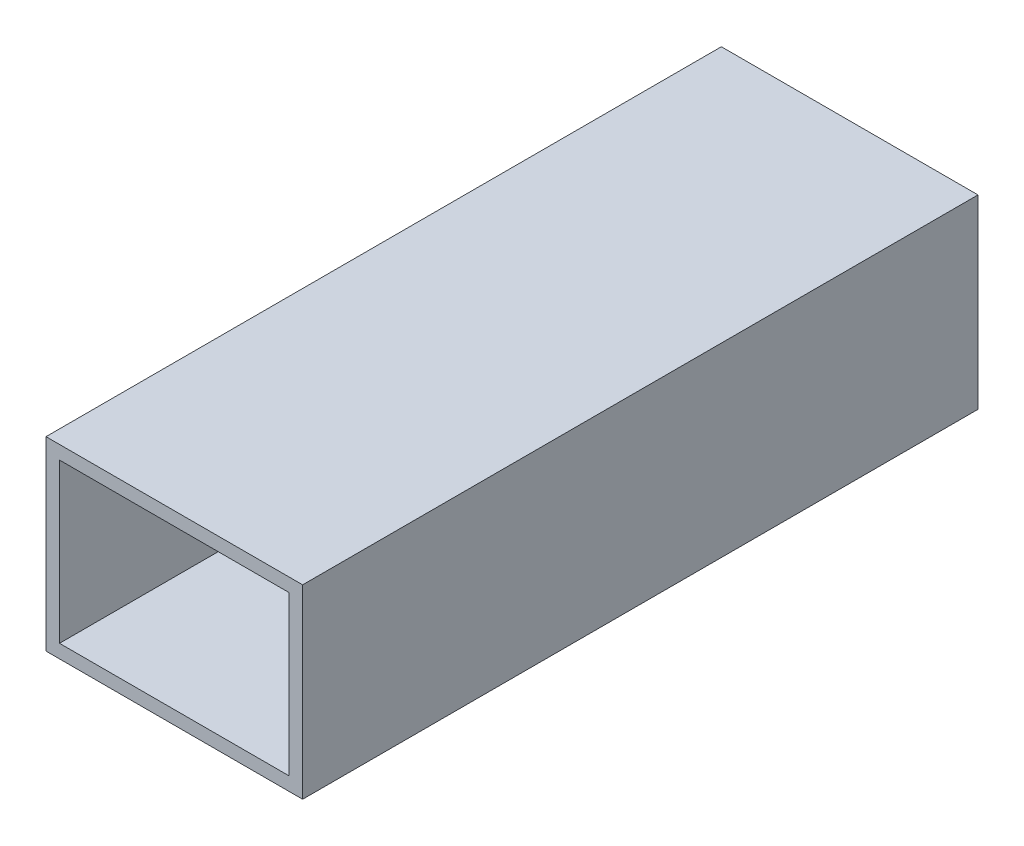
ISO-10303-21;
HEADER;
FILE_DESCRIPTION(('STEP AP214'),'2;1');
FILE_NAME('part.step','',(''),(''),'','','');
FILE_SCHEMA(('AUTOMOTIVE_DESIGN { 1 0 10303 214 1 1 1 1 }'));
ENDSEC;
DATA;
#1=APPLICATION_CONTEXT('core data for automotive mechanical design processes');
#2=APPLICATION_PROTOCOL_DEFINITION('international standard','automotive_design',2000,#1);
#3=PRODUCT_CONTEXT('',#1,'mechanical');
#4=PRODUCT('Part','Part','',(#3));
#5=PRODUCT_RELATED_PRODUCT_CATEGORY('part','',(#4));
#6=PRODUCT_DEFINITION_FORMATION('','',#4);
#7=PRODUCT_DEFINITION_CONTEXT('part definition',#1,'design');
#8=PRODUCT_DEFINITION('design','',#6,#7);
#9=PRODUCT_DEFINITION_SHAPE('','',#8);
#10=(LENGTH_UNIT() NAMED_UNIT(*) SI_UNIT(.MILLI.,.METRE.));
#11=(NAMED_UNIT(*) PLANE_ANGLE_UNIT() SI_UNIT($,.RADIAN.));
#12=(NAMED_UNIT(*) SI_UNIT($,.STERADIAN.) SOLID_ANGLE_UNIT());
#13=UNCERTAINTY_MEASURE_WITH_UNIT(LENGTH_MEASURE(1.E-05),#10,'distance_accuracy_value','');
#14=(GEOMETRIC_REPRESENTATION_CONTEXT(3) GLOBAL_UNCERTAINTY_ASSIGNED_CONTEXT((#13)) GLOBAL_UNIT_ASSIGNED_CONTEXT((#10,
#11,#12)) REPRESENTATION_CONTEXT('',''));
#15=CARTESIAN_POINT('',(0.,0.,0.));
#16=DIRECTION('',(0.,0.,1.));
#17=DIRECTION('',(1.,0.,0.));
#18=AXIS2_PLACEMENT_3D('',#15,#16,#17);
#19=CARTESIAN_POINT('',(0.,0.,100.));
#20=DIRECTION('',(0.,0.,1.));
#21=DIRECTION('',(1.,0.,0.));
#22=AXIS2_PLACEMENT_3D('',#19,#20,#21);
#23=PLANE('',#22);
#24=DIRECTION('',(0.,-1.,0.));
#25=VECTOR('',#24,1.);
#26=CARTESIAN_POINT('',(-17.1253333333333,14.6066666666667,100.));
#27=LINE('',#26,#25);
#28=CARTESIAN_POINT('',(-17.1253333333333,14.6066666666667,100.));
#29=VERTEX_POINT('',#28);
#30=CARTESIAN_POINT('',(-17.1253333333333,-12.8933333333333,100.));
#31=VERTEX_POINT('',#30);
#32=EDGE_CURVE('E135',#29,#31,#27,.T.);
#33=ORIENTED_EDGE('',*,*,#32,.T.);
#34=DIRECTION('',(1.,0.,0.));
#35=VECTOR('',#34,1.);
#36=CARTESIAN_POINT('',(-17.1253333333333,-12.8933333333333,100.));
#37=LINE('',#36,#35);
#38=CARTESIAN_POINT('',(20.8746666666667,-12.8933333333333,100.));
#39=VERTEX_POINT('',#38);
#40=EDGE_CURVE('E138',#31,#39,#37,.T.);
#41=ORIENTED_EDGE('',*,*,#40,.T.);
#42=DIRECTION('',(0.,1.,0.));
#43=VECTOR('',#42,1.);
#44=CARTESIAN_POINT('',(20.8746666666667,14.6066666666667,100.));
#45=LINE('',#44,#43);
#46=CARTESIAN_POINT('',(20.8746666666667,14.6066666666667,100.));
#47=VERTEX_POINT('',#46);
#48=EDGE_CURVE('E141',#39,#47,#45,.T.);
#49=ORIENTED_EDGE('',*,*,#48,.T.);
#50=DIRECTION('',(-1.,0.,0.));
#51=VECTOR('',#50,1.);
#52=CARTESIAN_POINT('',(-17.1253333333333,14.6066666666667,100.));
#53=LINE('',#52,#51);
#54=EDGE_CURVE('E143',#47,#29,#53,.T.);
#55=ORIENTED_EDGE('',*,*,#54,.T.);
#56=EDGE_LOOP('',(#33,#41,#49,#55));
#57=FACE_BOUND('',#56,.T.);
#58=DIRECTION('',(1.,0.,0.));
#59=VECTOR('',#58,1.);
#60=CARTESIAN_POINT('',(-15.1253333333333,-10.8933333333333,100.));
#61=LINE('',#60,#59);
#62=CARTESIAN_POINT('',(-15.1253333333333,-10.8933333333333,100.));
#63=VERTEX_POINT('',#62);
#64=CARTESIAN_POINT('',(18.8746666666667,-10.8933333333333,100.));
#65=VERTEX_POINT('',#64);
#66=EDGE_CURVE('E107',#63,#65,#61,.T.);
#67=ORIENTED_EDGE('',*,*,#66,.F.);
#68=DIRECTION('',(0.,-1.,0.));
#69=VECTOR('',#68,1.);
#70=CARTESIAN_POINT('',(-15.1253333333333,12.6066666666667,100.));
#71=LINE('',#70,#69);
#72=CARTESIAN_POINT('',(-15.1253333333333,12.6066666666667,100.));
#73=VERTEX_POINT('',#72);
#74=EDGE_CURVE('E99',#73,#63,#71,.T.);
#75=ORIENTED_EDGE('',*,*,#74,.F.);
#76=DIRECTION('',(-1.,0.,0.));
#77=VECTOR('',#76,1.);
#78=CARTESIAN_POINT('',(-15.1253333333333,12.6066666666667,100.));
#79=LINE('',#78,#77);
#80=CARTESIAN_POINT('',(18.8746666666667,12.6066666666667,100.));
#81=VERTEX_POINT('',#80);
#82=EDGE_CURVE('E121',#81,#73,#79,.T.);
#83=ORIENTED_EDGE('',*,*,#82,.F.);
#84=DIRECTION('',(0.,1.,0.));
#85=VECTOR('',#84,1.);
#86=CARTESIAN_POINT('',(18.8746666666667,12.6066666666667,100.));
#87=LINE('',#86,#85);
#88=EDGE_CURVE('E119',#65,#81,#87,.T.);
#89=ORIENTED_EDGE('',*,*,#88,.F.);
#90=EDGE_LOOP('',(#67,#75,#83,#89));
#91=FACE_BOUND('',#90,.T.);
#92=ADVANCED_FACE('F34',(#57,#91),#23,.T.);
#93=CARTESIAN_POINT('',(0.,0.,0.));
#94=DIRECTION('',(0.,0.,1.));
#95=DIRECTION('',(1.,0.,0.));
#96=AXIS2_PLACEMENT_3D('',#93,#94,#95);
#97=PLANE('',#96);
#98=DIRECTION('',(0.,-1.,0.));
#99=VECTOR('',#98,1.);
#100=CARTESIAN_POINT('',(-17.1253333333333,14.6066666666667,0.));
#101=LINE('',#100,#99);
#102=CARTESIAN_POINT('',(-17.1253333333333,14.6066666666667,0.));
#103=VERTEX_POINT('',#102);
#104=CARTESIAN_POINT('',(-17.1253333333333,-12.8933333333333,0.));
#105=VERTEX_POINT('',#104);
#106=EDGE_CURVE('E115',#103,#105,#101,.T.);
#107=ORIENTED_EDGE('',*,*,#106,.F.);
#108=DIRECTION('',(-1.,0.,0.));
#109=VECTOR('',#108,1.);
#110=CARTESIAN_POINT('',(-17.1253333333333,14.6066666666667,0.));
#111=LINE('',#110,#109);
#112=CARTESIAN_POINT('',(20.8746666666667,14.6066666666667,0.));
#113=VERTEX_POINT('',#112);
#114=EDGE_CURVE('E139',#113,#103,#111,.T.);
#115=ORIENTED_EDGE('',*,*,#114,.F.);
#116=DIRECTION('',(0.,1.,0.));
#117=VECTOR('',#116,1.);
#118=CARTESIAN_POINT('',(20.8746666666667,14.6066666666667,0.));
#119=LINE('',#118,#117);
#120=CARTESIAN_POINT('',(20.8746666666667,-12.8933333333333,0.));
#121=VERTEX_POINT('',#120);
#122=EDGE_CURVE('E150',#121,#113,#119,.T.);
#123=ORIENTED_EDGE('',*,*,#122,.F.);
#124=DIRECTION('',(1.,0.,0.));
#125=VECTOR('',#124,1.);
#126=CARTESIAN_POINT('',(-17.1253333333333,-12.8933333333333,0.));
#127=LINE('',#126,#125);
#128=EDGE_CURVE('E148',#105,#121,#127,.T.);
#129=ORIENTED_EDGE('',*,*,#128,.F.);
#130=EDGE_LOOP('',(#107,#115,#123,#129));
#131=FACE_BOUND('',#130,.T.);
#132=DIRECTION('',(0.,-1.,0.));
#133=VECTOR('',#132,1.);
#134=CARTESIAN_POINT('',(-15.1253333333333,12.6066666666667,0.));
#135=LINE('',#134,#133);
#136=CARTESIAN_POINT('',(-15.1253333333333,12.6066666666667,0.));
#137=VERTEX_POINT('',#136);
#138=CARTESIAN_POINT('',(-15.1253333333333,-10.8933333333333,0.));
#139=VERTEX_POINT('',#138);
#140=EDGE_CURVE('E57',#137,#139,#135,.T.);
#141=ORIENTED_EDGE('',*,*,#140,.T.);
#142=DIRECTION('',(1.,0.,0.));
#143=VECTOR('',#142,1.);
#144=CARTESIAN_POINT('',(-15.1253333333333,-10.8933333333333,0.));
#145=LINE('',#144,#143);
#146=CARTESIAN_POINT('',(18.8746666666667,-10.8933333333333,0.));
#147=VERTEX_POINT('',#146);
#148=EDGE_CURVE('E114',#139,#147,#145,.T.);
#149=ORIENTED_EDGE('',*,*,#148,.T.);
#150=DIRECTION('',(0.,1.,0.));
#151=VECTOR('',#150,1.);
#152=CARTESIAN_POINT('',(18.8746666666667,12.6066666666667,0.));
#153=LINE('',#152,#151);
#154=CARTESIAN_POINT('',(18.8746666666667,12.6066666666667,0.));
#155=VERTEX_POINT('',#154);
#156=EDGE_CURVE('E127',#147,#155,#153,.T.);
#157=ORIENTED_EDGE('',*,*,#156,.T.);
#158=DIRECTION('',(-1.,0.,0.));
#159=VECTOR('',#158,1.);
#160=CARTESIAN_POINT('',(-15.1253333333333,12.6066666666667,0.));
#161=LINE('',#160,#159);
#162=EDGE_CURVE('E108',#155,#137,#161,.T.);
#163=ORIENTED_EDGE('',*,*,#162,.T.);
#164=EDGE_LOOP('',(#141,#149,#157,#163));
#165=FACE_BOUND('',#164,.T.);
#166=ADVANCED_FACE('F168',(#131,#165),#97,.F.);
#167=CARTESIAN_POINT('',(-17.1253333333333,14.6066666666667,100.));
#168=DIRECTION('',(1.,0.,0.));
#169=DIRECTION('',(0.,0.,-1.));
#170=AXIS2_PLACEMENT_3D('',#167,#168,#169);
#171=PLANE('',#170);
#172=ORIENTED_EDGE('',*,*,#106,.T.);
#173=DIRECTION('',(0.,0.,-1.));
#174=VECTOR('',#173,1.);
#175=CARTESIAN_POINT('',(-17.1253333333333,-12.8933333333333,100.));
#176=LINE('',#175,#174);
#177=EDGE_CURVE('E11',#31,#105,#176,.T.);
#178=ORIENTED_EDGE('',*,*,#177,.F.);
#179=ORIENTED_EDGE('',*,*,#32,.F.);
#180=DIRECTION('',(0.,0.,-1.));
#181=VECTOR('',#180,1.);
#182=CARTESIAN_POINT('',(-17.1253333333333,14.6066666666667,100.));
#183=LINE('',#182,#181);
#184=EDGE_CURVE('E145',#29,#103,#183,.T.);
#185=ORIENTED_EDGE('',*,*,#184,.T.);
#186=EDGE_LOOP('',(#172,#178,#179,#185));
#187=FACE_BOUND('',#186,.T.);
#188=ADVANCED_FACE('F36',(#187),#171,.F.);
#189=CARTESIAN_POINT('',(-17.1253333333333,-12.8933333333333,100.));
#190=DIRECTION('',(0.,1.,0.));
#191=DIRECTION('',(-1.,0.,0.));
#192=AXIS2_PLACEMENT_3D('',#189,#190,#191);
#193=PLANE('',#192);
#194=ORIENTED_EDGE('',*,*,#128,.T.);
#195=DIRECTION('',(0.,0.,-1.));
#196=VECTOR('',#195,1.);
#197=CARTESIAN_POINT('',(20.8746666666667,-12.8933333333333,100.));
#198=LINE('',#197,#196);
#199=EDGE_CURVE('E42',#39,#121,#198,.T.);
#200=ORIENTED_EDGE('',*,*,#199,.F.);
#201=ORIENTED_EDGE('',*,*,#40,.F.);
#202=ORIENTED_EDGE('',*,*,#177,.T.);
#203=EDGE_LOOP('',(#194,#200,#201,#202));
#204=FACE_BOUND('',#203,.T.);
#205=ADVANCED_FACE('F178',(#204),#193,.F.);
#206=CARTESIAN_POINT('',(20.8746666666667,14.6066666666667,100.));
#207=DIRECTION('',(-1.,0.,0.));
#208=DIRECTION('',(0.,-1.,0.));
#209=AXIS2_PLACEMENT_3D('',#206,#207,#208);
#210=PLANE('',#209);
#211=ORIENTED_EDGE('',*,*,#122,.T.);
#212=DIRECTION('',(0.,0.,-1.));
#213=VECTOR('',#212,1.);
#214=CARTESIAN_POINT('',(20.8746666666667,14.6066666666667,100.));
#215=LINE('',#214,#213);
#216=EDGE_CURVE('E155',#47,#113,#215,.T.);
#217=ORIENTED_EDGE('',*,*,#216,.F.);
#218=ORIENTED_EDGE('',*,*,#48,.F.);
#219=ORIENTED_EDGE('',*,*,#199,.T.);
#220=EDGE_LOOP('',(#211,#217,#218,#219));
#221=FACE_BOUND('',#220,.T.);
#222=ADVANCED_FACE('F162',(#221),#210,.F.);
#223=CARTESIAN_POINT('',(-17.1253333333333,14.6066666666667,100.));
#224=DIRECTION('',(0.,-1.,0.));
#225=DIRECTION('',(0.,0.,-1.));
#226=AXIS2_PLACEMENT_3D('',#223,#224,#225);
#227=PLANE('',#226);
#228=ORIENTED_EDGE('',*,*,#114,.T.);
#229=ORIENTED_EDGE('',*,*,#184,.F.);
#230=ORIENTED_EDGE('',*,*,#54,.F.);
#231=ORIENTED_EDGE('',*,*,#216,.T.);
#232=EDGE_LOOP('',(#228,#229,#230,#231));
#233=FACE_BOUND('',#232,.T.);
#234=ADVANCED_FACE('F172',(#233),#227,.F.);
#235=CARTESIAN_POINT('',(-15.1253333333333,12.6066666666667,100.));
#236=DIRECTION('',(1.,0.,0.));
#237=DIRECTION('',(0.,1.,0.));
#238=AXIS2_PLACEMENT_3D('',#235,#236,#237);
#239=PLANE('',#238);
#240=ORIENTED_EDGE('',*,*,#140,.F.);
#241=DIRECTION('',(0.,0.,-1.));
#242=VECTOR('',#241,1.);
#243=CARTESIAN_POINT('',(-15.1253333333333,12.6066666666667,100.));
#244=LINE('',#243,#242);
#245=EDGE_CURVE('E103',#73,#137,#244,.T.);
#246=ORIENTED_EDGE('',*,*,#245,.F.);
#247=ORIENTED_EDGE('',*,*,#74,.T.);
#248=DIRECTION('',(0.,0.,-1.));
#249=VECTOR('',#248,1.);
#250=CARTESIAN_POINT('',(-15.1253333333333,-10.8933333333333,100.));
#251=LINE('',#250,#249);
#252=EDGE_CURVE('E102',#63,#139,#251,.T.);
#253=ORIENTED_EDGE('',*,*,#252,.T.);
#254=EDGE_LOOP('',(#240,#246,#247,#253));
#255=FACE_BOUND('',#254,.T.);
#256=ADVANCED_FACE('F101',(#255),#239,.T.);
#257=CARTESIAN_POINT('',(-15.1253333333333,-10.8933333333333,100.));
#258=DIRECTION('',(0.,1.,0.));
#259=DIRECTION('',(0.,0.,1.));
#260=AXIS2_PLACEMENT_3D('',#257,#258,#259);
#261=PLANE('',#260);
#262=ORIENTED_EDGE('',*,*,#148,.F.);
#263=ORIENTED_EDGE('',*,*,#252,.F.);
#264=ORIENTED_EDGE('',*,*,#66,.T.);
#265=DIRECTION('',(0.,0.,-1.));
#266=VECTOR('',#265,1.);
#267=CARTESIAN_POINT('',(18.8746666666667,-10.8933333333333,100.));
#268=LINE('',#267,#266);
#269=EDGE_CURVE('E116',#65,#147,#268,.T.);
#270=ORIENTED_EDGE('',*,*,#269,.T.);
#271=EDGE_LOOP('',(#262,#263,#264,#270));
#272=FACE_BOUND('',#271,.T.);
#273=ADVANCED_FACE('F111',(#272),#261,.T.);
#274=CARTESIAN_POINT('',(18.8746666666667,12.6066666666667,100.));
#275=DIRECTION('',(-1.,0.,0.));
#276=DIRECTION('',(0.,0.,1.));
#277=AXIS2_PLACEMENT_3D('',#274,#275,#276);
#278=PLANE('',#277);
#279=ORIENTED_EDGE('',*,*,#156,.F.);
#280=ORIENTED_EDGE('',*,*,#269,.F.);
#281=ORIENTED_EDGE('',*,*,#88,.T.);
#282=DIRECTION('',(0.,0.,-1.));
#283=VECTOR('',#282,1.);
#284=CARTESIAN_POINT('',(18.8746666666667,12.6066666666667,100.));
#285=LINE('',#284,#283);
#286=EDGE_CURVE('E49',#81,#155,#285,.T.);
#287=ORIENTED_EDGE('',*,*,#286,.T.);
#288=EDGE_LOOP('',(#279,#280,#281,#287));
#289=FACE_BOUND('',#288,.T.);
#290=ADVANCED_FACE('F201',(#289),#278,.T.);
#291=CARTESIAN_POINT('',(-15.1253333333333,12.6066666666667,100.));
#292=DIRECTION('',(0.,-1.,0.));
#293=DIRECTION('',(0.,0.,-1.));
#294=AXIS2_PLACEMENT_3D('',#291,#292,#293);
#295=PLANE('',#294);
#296=ORIENTED_EDGE('',*,*,#162,.F.);
#297=ORIENTED_EDGE('',*,*,#286,.F.);
#298=ORIENTED_EDGE('',*,*,#82,.T.);
#299=ORIENTED_EDGE('',*,*,#245,.T.);
#300=EDGE_LOOP('',(#296,#297,#298,#299));
#301=FACE_BOUND('',#300,.T.);
#302=ADVANCED_FACE('F205',(#301),#295,.T.);
#303=CLOSED_SHELL('',(#92,#166,#188,#205,#222,#234,#256,#273,#290,#302));
#304=MANIFOLD_SOLID_BREP('B2',#303);
#305=ADVANCED_BREP_SHAPE_REPRESENTATION('',(#18,#304),#14);
#306=SHAPE_DEFINITION_REPRESENTATION(#9,#305);
ENDSEC;
END-ISO-10303-21;
